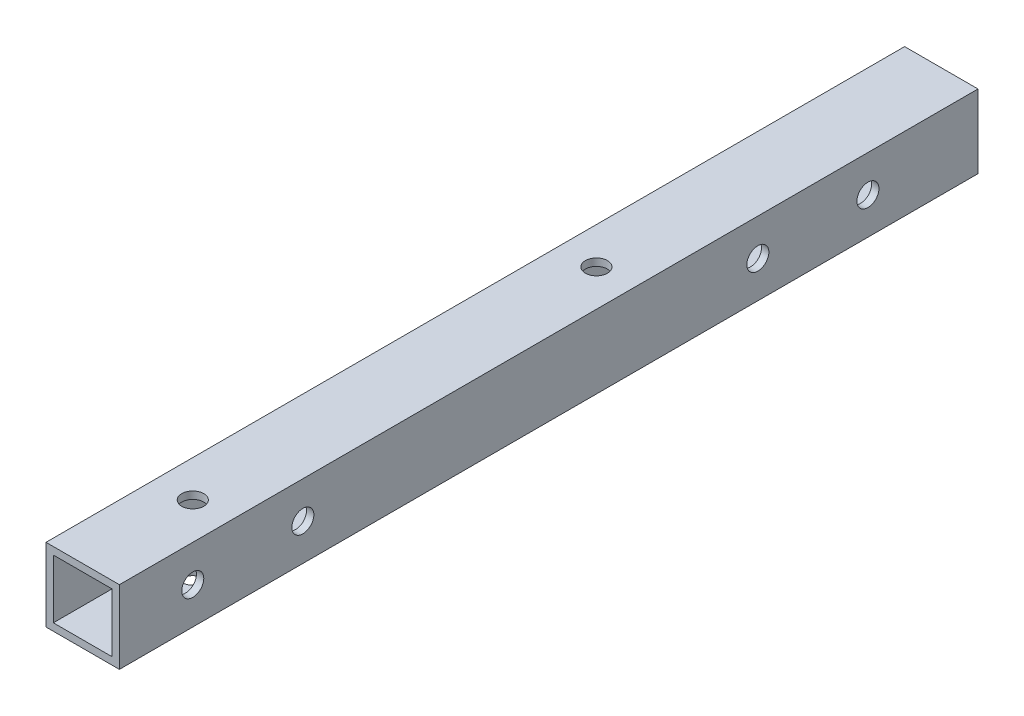
ISO-10303-21;
HEADER;
FILE_DESCRIPTION(('STEP AP214'),'2;1');
FILE_NAME('part.step','',(''),(''),'','','');
FILE_SCHEMA(('AUTOMOTIVE_DESIGN { 1 0 10303 214 1 1 1 1 }'));
ENDSEC;
DATA;
#1=APPLICATION_CONTEXT('core data for automotive mechanical design processes');
#2=APPLICATION_PROTOCOL_DEFINITION('international standard','automotive_design',2000,#1);
#3=PRODUCT_CONTEXT('',#1,'mechanical');
#4=PRODUCT('Part','Part','',(#3));
#5=PRODUCT_RELATED_PRODUCT_CATEGORY('part','',(#4));
#6=PRODUCT_DEFINITION_FORMATION('','',#4);
#7=PRODUCT_DEFINITION_CONTEXT('part definition',#1,'design');
#8=PRODUCT_DEFINITION('design','',#6,#7);
#9=PRODUCT_DEFINITION_SHAPE('','',#8);
#10=(LENGTH_UNIT() NAMED_UNIT(*) SI_UNIT(.MILLI.,.METRE.));
#11=(NAMED_UNIT(*) PLANE_ANGLE_UNIT() SI_UNIT($,.RADIAN.));
#12=(NAMED_UNIT(*) SI_UNIT($,.STERADIAN.) SOLID_ANGLE_UNIT());
#13=UNCERTAINTY_MEASURE_WITH_UNIT(LENGTH_MEASURE(1.E-05),#10,'distance_accuracy_value','');
#14=(GEOMETRIC_REPRESENTATION_CONTEXT(3) GLOBAL_UNCERTAINTY_ASSIGNED_CONTEXT((#13)) GLOBAL_UNIT_ASSIGNED_CONTEXT((#10,
#11,#12)) REPRESENTATION_CONTEXT('',''));
#15=CARTESIAN_POINT('',(0.,0.,0.));
#16=DIRECTION('',(0.,0.,1.));
#17=DIRECTION('',(1.,0.,0.));
#18=AXIS2_PLACEMENT_3D('',#15,#16,#17);
#19=CARTESIAN_POINT('',(0.,0.,117.));
#20=DIRECTION('',(0.,0.,1.));
#21=DIRECTION('',(1.,0.,0.));
#22=AXIS2_PLACEMENT_3D('',#19,#20,#21);
#23=PLANE('',#22);
#24=DIRECTION('',(0.,-1.,0.));
#25=VECTOR('',#24,1.);
#26=CARTESIAN_POINT('',(-5.,-5.,117.));
#27=LINE('',#26,#25);
#28=CARTESIAN_POINT('',(-5.,5.,117.));
#29=VERTEX_POINT('',#28);
#30=CARTESIAN_POINT('',(-5.,-5.,117.));
#31=VERTEX_POINT('',#30);
#32=EDGE_CURVE('E170',#29,#31,#27,.T.);
#33=ORIENTED_EDGE('',*,*,#32,.T.);
#34=DIRECTION('',(1.,0.,0.));
#35=VECTOR('',#34,1.);
#36=CARTESIAN_POINT('',(-5.,-5.,117.));
#37=LINE('',#36,#35);
#38=CARTESIAN_POINT('',(5.,-5.,117.));
#39=VERTEX_POINT('',#38);
#40=EDGE_CURVE('E173',#31,#39,#37,.T.);
#41=ORIENTED_EDGE('',*,*,#40,.T.);
#42=DIRECTION('',(0.,1.,0.));
#43=VECTOR('',#42,1.);
#44=CARTESIAN_POINT('',(5.,-5.,117.));
#45=LINE('',#44,#43);
#46=CARTESIAN_POINT('',(5.,5.,117.));
#47=VERTEX_POINT('',#46);
#48=EDGE_CURVE('E176',#39,#47,#45,.T.);
#49=ORIENTED_EDGE('',*,*,#48,.T.);
#50=DIRECTION('',(-1.,0.,0.));
#51=VECTOR('',#50,1.);
#52=CARTESIAN_POINT('',(-5.,5.,117.));
#53=LINE('',#52,#51);
#54=EDGE_CURVE('E178',#47,#29,#53,.T.);
#55=ORIENTED_EDGE('',*,*,#54,.T.);
#56=EDGE_LOOP('',(#33,#41,#49,#55));
#57=FACE_BOUND('',#56,.T.);
#58=DIRECTION('',(1.,0.,0.));
#59=VECTOR('',#58,1.);
#60=CARTESIAN_POINT('',(0.,-4.,117.));
#61=LINE('',#60,#59);
#62=CARTESIAN_POINT('',(-4.,-4.,117.));
#63=VERTEX_POINT('',#62);
#64=CARTESIAN_POINT('',(4.,-4.,117.));
#65=VERTEX_POINT('',#64);
#66=EDGE_CURVE('E140',#63,#65,#61,.T.);
#67=ORIENTED_EDGE('',*,*,#66,.F.);
#68=DIRECTION('',(0.,-1.,0.));
#69=VECTOR('',#68,1.);
#70=CARTESIAN_POINT('',(-4.,0.,117.));
#71=LINE('',#70,#69);
#72=CARTESIAN_POINT('',(-4.,4.,117.));
#73=VERTEX_POINT('',#72);
#74=EDGE_CURVE('E132',#73,#63,#71,.T.);
#75=ORIENTED_EDGE('',*,*,#74,.F.);
#76=DIRECTION('',(-1.,0.,0.));
#77=VECTOR('',#76,1.);
#78=CARTESIAN_POINT('',(0.,4.,117.));
#79=LINE('',#78,#77);
#80=CARTESIAN_POINT('',(4.,4.,117.));
#81=VERTEX_POINT('',#80);
#82=EDGE_CURVE('E154',#81,#73,#79,.T.);
#83=ORIENTED_EDGE('',*,*,#82,.F.);
#84=DIRECTION('',(0.,1.,0.));
#85=VECTOR('',#84,1.);
#86=CARTESIAN_POINT('',(4.,0.,117.));
#87=LINE('',#86,#85);
#88=EDGE_CURVE('E152',#65,#81,#87,.T.);
#89=ORIENTED_EDGE('',*,*,#88,.F.);
#90=EDGE_LOOP('',(#67,#75,#83,#89));
#91=FACE_BOUND('',#90,.T.);
#92=ADVANCED_FACE('F65',(#57,#91),#23,.T.);
#93=CARTESIAN_POINT('',(0.,0.,0.));
#94=DIRECTION('',(0.,0.,1.));
#95=DIRECTION('',(1.,0.,0.));
#96=AXIS2_PLACEMENT_3D('',#93,#94,#95);
#97=PLANE('',#96);
#98=DIRECTION('',(0.,-1.,0.));
#99=VECTOR('',#98,1.);
#100=CARTESIAN_POINT('',(-5.,-5.,0.));
#101=LINE('',#100,#99);
#102=CARTESIAN_POINT('',(-5.,5.,0.));
#103=VERTEX_POINT('',#102);
#104=CARTESIAN_POINT('',(-5.,-5.,0.));
#105=VERTEX_POINT('',#104);
#106=EDGE_CURVE('E148',#103,#105,#101,.T.);
#107=ORIENTED_EDGE('',*,*,#106,.F.);
#108=DIRECTION('',(-1.,0.,0.));
#109=VECTOR('',#108,1.);
#110=CARTESIAN_POINT('',(-5.,5.,0.));
#111=LINE('',#110,#109);
#112=CARTESIAN_POINT('',(5.,5.,0.));
#113=VERTEX_POINT('',#112);
#114=EDGE_CURVE('E174',#113,#103,#111,.T.);
#115=ORIENTED_EDGE('',*,*,#114,.F.);
#116=DIRECTION('',(0.,1.,0.));
#117=VECTOR('',#116,1.);
#118=CARTESIAN_POINT('',(5.,-5.,0.));
#119=LINE('',#118,#117);
#120=CARTESIAN_POINT('',(5.,-5.,0.));
#121=VERTEX_POINT('',#120);
#122=EDGE_CURVE('E185',#121,#113,#119,.T.);
#123=ORIENTED_EDGE('',*,*,#122,.F.);
#124=DIRECTION('',(1.,0.,0.));
#125=VECTOR('',#124,1.);
#126=CARTESIAN_POINT('',(-5.,-5.,0.));
#127=LINE('',#126,#125);
#128=EDGE_CURVE('E183',#105,#121,#127,.T.);
#129=ORIENTED_EDGE('',*,*,#128,.F.);
#130=EDGE_LOOP('',(#107,#115,#123,#129));
#131=FACE_BOUND('',#130,.T.);
#132=DIRECTION('',(0.,-1.,0.));
#133=VECTOR('',#132,1.);
#134=CARTESIAN_POINT('',(-4.,0.,0.));
#135=LINE('',#134,#133);
#136=CARTESIAN_POINT('',(-4.,4.,0.));
#137=VERTEX_POINT('',#136);
#138=CARTESIAN_POINT('',(-4.,-4.,0.));
#139=VERTEX_POINT('',#138);
#140=EDGE_CURVE('E90',#137,#139,#135,.T.);
#141=ORIENTED_EDGE('',*,*,#140,.T.);
#142=DIRECTION('',(1.,0.,0.));
#143=VECTOR('',#142,1.);
#144=CARTESIAN_POINT('',(0.,-4.,0.));
#145=LINE('',#144,#143);
#146=CARTESIAN_POINT('',(4.,-4.,0.));
#147=VERTEX_POINT('',#146);
#148=EDGE_CURVE('E147',#139,#147,#145,.T.);
#149=ORIENTED_EDGE('',*,*,#148,.T.);
#150=DIRECTION('',(0.,1.,0.));
#151=VECTOR('',#150,1.);
#152=CARTESIAN_POINT('',(4.,0.,0.));
#153=LINE('',#152,#151);
#154=CARTESIAN_POINT('',(4.,4.,0.));
#155=VERTEX_POINT('',#154);
#156=EDGE_CURVE('E162',#147,#155,#153,.T.);
#157=ORIENTED_EDGE('',*,*,#156,.T.);
#158=DIRECTION('',(-1.,0.,0.));
#159=VECTOR('',#158,1.);
#160=CARTESIAN_POINT('',(0.,4.,0.));
#161=LINE('',#160,#159);
#162=EDGE_CURVE('E141',#155,#137,#161,.T.);
#163=ORIENTED_EDGE('',*,*,#162,.T.);
#164=EDGE_LOOP('',(#141,#149,#157,#163));
#165=FACE_BOUND('',#164,.T.);
#166=ADVANCED_FACE('F291',(#131,#165),#97,.F.);
#167=CARTESIAN_POINT('',(-5.,-5.,117.));
#168=DIRECTION('',(1.,0.,0.));
#169=DIRECTION('',(0.,0.,-1.));
#170=AXIS2_PLACEMENT_3D('',#167,#168,#169);
#171=PLANE('',#170);
#172=CARTESIAN_POINT('',(-5.,0.,15.));
#173=DIRECTION('',(1.,0.,0.));
#174=DIRECTION('',(0.,0.,-1.));
#175=AXIS2_PLACEMENT_3D('',#172,#173,#174);
#176=CIRCLE('',#175,1.5);
#177=CARTESIAN_POINT('',(-5.,0.,13.5));
#178=VERTEX_POINT('',#177);
#179=EDGE_CURVE('E199',#178,#178,#176,.T.);
#180=ORIENTED_EDGE('',*,*,#179,.T.);
#181=EDGE_LOOP('',(#180));
#182=FACE_BOUND('',#181,.T.);
#183=CARTESIAN_POINT('',(-5.,0.,92.));
#184=DIRECTION('',(1.,0.,0.));
#185=DIRECTION('',(0.,0.,-1.));
#186=AXIS2_PLACEMENT_3D('',#183,#184,#185);
#187=CIRCLE('',#186,1.5);
#188=CARTESIAN_POINT('',(-5.,0.,90.5));
#189=VERTEX_POINT('',#188);
#190=EDGE_CURVE('E235',#189,#189,#187,.T.);
#191=ORIENTED_EDGE('',*,*,#190,.T.);
#192=EDGE_LOOP('',(#191));
#193=FACE_BOUND('',#192,.T.);
#194=CARTESIAN_POINT('',(-5.,0.,107.));
#195=DIRECTION('',(1.,0.,0.));
#196=DIRECTION('',(0.,0.,-1.));
#197=AXIS2_PLACEMENT_3D('',#194,#195,#196);
#198=CIRCLE('',#197,1.5);
#199=CARTESIAN_POINT('',(-5.,0.,105.5));
#200=VERTEX_POINT('',#199);
#201=EDGE_CURVE('E245',#200,#200,#198,.T.);
#202=ORIENTED_EDGE('',*,*,#201,.T.);
#203=EDGE_LOOP('',(#202));
#204=FACE_BOUND('',#203,.T.);
#205=CARTESIAN_POINT('',(-5.,0.,30.));
#206=DIRECTION('',(1.,0.,0.));
#207=DIRECTION('',(0.,0.,-1.));
#208=AXIS2_PLACEMENT_3D('',#205,#206,#207);
#209=CIRCLE('',#208,1.5);
#210=CARTESIAN_POINT('',(-5.,0.,28.5));
#211=VERTEX_POINT('',#210);
#212=EDGE_CURVE('E250',#211,#211,#209,.T.);
#213=ORIENTED_EDGE('',*,*,#212,.T.);
#214=EDGE_LOOP('',(#213));
#215=FACE_BOUND('',#214,.T.);
#216=ORIENTED_EDGE('',*,*,#106,.T.);
#217=DIRECTION('',(0.,0.,-1.));
#218=VECTOR('',#217,1.);
#219=CARTESIAN_POINT('',(-5.,-5.,117.));
#220=LINE('',#219,#218);
#221=EDGE_CURVE('E12',#31,#105,#220,.T.);
#222=ORIENTED_EDGE('',*,*,#221,.F.);
#223=ORIENTED_EDGE('',*,*,#32,.F.);
#224=DIRECTION('',(0.,0.,-1.));
#225=VECTOR('',#224,1.);
#226=CARTESIAN_POINT('',(-5.,5.,117.));
#227=LINE('',#226,#225);
#228=EDGE_CURVE('E180',#29,#103,#227,.T.);
#229=ORIENTED_EDGE('',*,*,#228,.T.);
#230=EDGE_LOOP('',(#216,#222,#223,#229));
#231=FACE_BOUND('',#230,.T.);
#232=ADVANCED_FACE('F67',(#182,#193,#204,#215,#231),#171,.F.);
#233=CARTESIAN_POINT('',(-5.,-5.,117.));
#234=DIRECTION('',(0.,1.,0.));
#235=DIRECTION('',(0.,0.,1.));
#236=AXIS2_PLACEMENT_3D('',#233,#234,#235);
#237=PLANE('',#236);
#238=CARTESIAN_POINT('',(0.,-5.,102.));
#239=DIRECTION('',(0.,-1.,0.));
#240=DIRECTION('',(0.,0.,-1.));
#241=AXIS2_PLACEMENT_3D('',#238,#239,#240);
#242=CIRCLE('',#241,1.5);
#243=CARTESIAN_POINT('',(0.,-5.,100.5));
#244=VERTEX_POINT('',#243);
#245=EDGE_CURVE('E219',#244,#244,#242,.T.);
#246=ORIENTED_EDGE('',*,*,#245,.F.);
#247=EDGE_LOOP('',(#246));
#248=FACE_BOUND('',#247,.T.);
#249=CARTESIAN_POINT('',(0.,-5.,47.));
#250=DIRECTION('',(0.,-1.,0.));
#251=DIRECTION('',(0.,0.,-1.));
#252=AXIS2_PLACEMENT_3D('',#249,#250,#251);
#253=CIRCLE('',#252,1.5);
#254=CARTESIAN_POINT('',(0.,-5.,45.5));
#255=VERTEX_POINT('',#254);
#256=EDGE_CURVE('E224',#255,#255,#253,.T.);
#257=ORIENTED_EDGE('',*,*,#256,.F.);
#258=EDGE_LOOP('',(#257));
#259=FACE_BOUND('',#258,.T.);
#260=ORIENTED_EDGE('',*,*,#128,.T.);
#261=DIRECTION('',(0.,0.,-1.));
#262=VECTOR('',#261,1.);
#263=CARTESIAN_POINT('',(5.,-5.,117.));
#264=LINE('',#263,#262);
#265=EDGE_CURVE('E74',#39,#121,#264,.T.);
#266=ORIENTED_EDGE('',*,*,#265,.F.);
#267=ORIENTED_EDGE('',*,*,#40,.F.);
#268=ORIENTED_EDGE('',*,*,#221,.T.);
#269=EDGE_LOOP('',(#260,#266,#267,#268));
#270=FACE_BOUND('',#269,.T.);
#271=ADVANCED_FACE('F290',(#248,#259,#270),#237,.F.);
#272=CARTESIAN_POINT('',(5.,-5.,117.));
#273=DIRECTION('',(-1.,0.,0.));
#274=DIRECTION('',(0.,0.,1.));
#275=AXIS2_PLACEMENT_3D('',#272,#273,#274);
#276=PLANE('',#275);
#277=CARTESIAN_POINT('',(5.,0.,15.));
#278=DIRECTION('',(1.,0.,0.));
#279=DIRECTION('',(0.,0.,-1.));
#280=AXIS2_PLACEMENT_3D('',#277,#278,#279);
#281=CIRCLE('',#280,1.5);
#282=CARTESIAN_POINT('',(5.,0.,13.5));
#283=VERTEX_POINT('',#282);
#284=EDGE_CURVE('E238',#283,#283,#281,.T.);
#285=ORIENTED_EDGE('',*,*,#284,.F.);
#286=EDGE_LOOP('',(#285));
#287=FACE_BOUND('',#286,.T.);
#288=CARTESIAN_POINT('',(5.,0.,92.));
#289=DIRECTION('',(1.,0.,0.));
#290=DIRECTION('',(0.,0.,-1.));
#291=AXIS2_PLACEMENT_3D('',#288,#289,#290);
#292=CIRCLE('',#291,1.5);
#293=CARTESIAN_POINT('',(5.,0.,90.5));
#294=VERTEX_POINT('',#293);
#295=EDGE_CURVE('E242',#294,#294,#292,.T.);
#296=ORIENTED_EDGE('',*,*,#295,.F.);
#297=EDGE_LOOP('',(#296));
#298=FACE_BOUND('',#297,.T.);
#299=CARTESIAN_POINT('',(5.,0.,107.));
#300=DIRECTION('',(1.,0.,0.));
#301=DIRECTION('',(0.,0.,-1.));
#302=AXIS2_PLACEMENT_3D('',#299,#300,#301);
#303=CIRCLE('',#302,1.5);
#304=CARTESIAN_POINT('',(5.,0.,105.5));
#305=VERTEX_POINT('',#304);
#306=EDGE_CURVE('E253',#305,#305,#303,.T.);
#307=ORIENTED_EDGE('',*,*,#306,.F.);
#308=EDGE_LOOP('',(#307));
#309=FACE_BOUND('',#308,.T.);
#310=CARTESIAN_POINT('',(5.,0.,30.));
#311=DIRECTION('',(1.,0.,0.));
#312=DIRECTION('',(0.,0.,-1.));
#313=AXIS2_PLACEMENT_3D('',#310,#311,#312);
#314=CIRCLE('',#313,1.5);
#315=CARTESIAN_POINT('',(5.,0.,28.5));
#316=VERTEX_POINT('',#315);
#317=EDGE_CURVE('E241',#316,#316,#314,.T.);
#318=ORIENTED_EDGE('',*,*,#317,.F.);
#319=EDGE_LOOP('',(#318));
#320=FACE_BOUND('',#319,.T.);
#321=ORIENTED_EDGE('',*,*,#122,.T.);
#322=DIRECTION('',(0.,0.,-1.));
#323=VECTOR('',#322,1.);
#324=CARTESIAN_POINT('',(5.,5.,117.));
#325=LINE('',#324,#323);
#326=EDGE_CURVE('E190',#47,#113,#325,.T.);
#327=ORIENTED_EDGE('',*,*,#326,.F.);
#328=ORIENTED_EDGE('',*,*,#48,.F.);
#329=ORIENTED_EDGE('',*,*,#265,.T.);
#330=EDGE_LOOP('',(#321,#327,#328,#329));
#331=FACE_BOUND('',#330,.T.);
#332=ADVANCED_FACE('F309',(#287,#298,#309,#320,#331),#276,.F.);
#333=CARTESIAN_POINT('',(-5.,5.,117.));
#334=DIRECTION('',(0.,-1.,0.));
#335=DIRECTION('',(0.,0.,-1.));
#336=AXIS2_PLACEMENT_3D('',#333,#334,#335);
#337=PLANE('',#336);
#338=CARTESIAN_POINT('',(0.,5.,102.));
#339=DIRECTION('',(0.,-1.,0.));
#340=DIRECTION('',(0.,0.,-1.));
#341=AXIS2_PLACEMENT_3D('',#338,#339,#340);
#342=CIRCLE('',#341,1.5);
#343=CARTESIAN_POINT('',(0.,5.,100.5));
#344=VERTEX_POINT('',#343);
#345=EDGE_CURVE('E213',#344,#344,#342,.T.);
#346=ORIENTED_EDGE('',*,*,#345,.T.);
#347=EDGE_LOOP('',(#346));
#348=FACE_BOUND('',#347,.T.);
#349=CARTESIAN_POINT('',(0.,5.,47.));
#350=DIRECTION('',(0.,-1.,0.));
#351=DIRECTION('',(0.,0.,-1.));
#352=AXIS2_PLACEMENT_3D('',#349,#350,#351);
#353=CIRCLE('',#352,1.5);
#354=CARTESIAN_POINT('',(0.,5.,45.5));
#355=VERTEX_POINT('',#354);
#356=EDGE_CURVE('E229',#355,#355,#353,.T.);
#357=ORIENTED_EDGE('',*,*,#356,.T.);
#358=EDGE_LOOP('',(#357));
#359=FACE_BOUND('',#358,.T.);
#360=ORIENTED_EDGE('',*,*,#114,.T.);
#361=ORIENTED_EDGE('',*,*,#228,.F.);
#362=ORIENTED_EDGE('',*,*,#54,.F.);
#363=ORIENTED_EDGE('',*,*,#326,.T.);
#364=EDGE_LOOP('',(#360,#361,#362,#363));
#365=FACE_BOUND('',#364,.T.);
#366=ADVANCED_FACE('F271',(#348,#359,#365),#337,.F.);
#367=CARTESIAN_POINT('',(-4.,0.,117.));
#368=DIRECTION('',(1.,0.,0.));
#369=DIRECTION('',(0.,0.,-1.));
#370=AXIS2_PLACEMENT_3D('',#367,#368,#369);
#371=PLANE('',#370);
#372=CARTESIAN_POINT('',(-4.,0.,15.));
#373=DIRECTION('',(1.,0.,0.));
#374=DIRECTION('',(0.,0.,-1.));
#375=AXIS2_PLACEMENT_3D('',#372,#373,#374);
#376=CIRCLE('',#375,1.5);
#377=CARTESIAN_POINT('',(-4.,0.,13.5));
#378=VERTEX_POINT('',#377);
#379=EDGE_CURVE('E160',#378,#378,#376,.T.);
#380=ORIENTED_EDGE('',*,*,#379,.F.);
#381=EDGE_LOOP('',(#380));
#382=FACE_BOUND('',#381,.T.);
#383=CARTESIAN_POINT('',(-4.,0.,92.));
#384=DIRECTION('',(1.,0.,0.));
#385=DIRECTION('',(0.,0.,-1.));
#386=AXIS2_PLACEMENT_3D('',#383,#384,#385);
#387=CIRCLE('',#386,1.5);
#388=CARTESIAN_POINT('',(-4.,0.,90.5));
#389=VERTEX_POINT('',#388);
#390=EDGE_CURVE('E207',#389,#389,#387,.T.);
#391=ORIENTED_EDGE('',*,*,#390,.F.);
#392=EDGE_LOOP('',(#391));
#393=FACE_BOUND('',#392,.T.);
#394=CARTESIAN_POINT('',(-4.,0.,107.));
#395=DIRECTION('',(1.,0.,0.));
#396=DIRECTION('',(0.,0.,-1.));
#397=AXIS2_PLACEMENT_3D('',#394,#395,#396);
#398=CIRCLE('',#397,1.5);
#399=CARTESIAN_POINT('',(-4.,0.,105.5));
#400=VERTEX_POINT('',#399);
#401=EDGE_CURVE('E203',#400,#400,#398,.T.);
#402=ORIENTED_EDGE('',*,*,#401,.F.);
#403=EDGE_LOOP('',(#402));
#404=FACE_BOUND('',#403,.T.);
#405=CARTESIAN_POINT('',(-4.,0.,30.));
#406=DIRECTION('',(1.,0.,0.));
#407=DIRECTION('',(0.,0.,-1.));
#408=AXIS2_PLACEMENT_3D('',#405,#406,#407);
#409=CIRCLE('',#408,1.5);
#410=CARTESIAN_POINT('',(-4.,0.,28.5));
#411=VERTEX_POINT('',#410);
#412=EDGE_CURVE('E198',#411,#411,#409,.T.);
#413=ORIENTED_EDGE('',*,*,#412,.F.);
#414=EDGE_LOOP('',(#413));
#415=FACE_BOUND('',#414,.T.);
#416=ORIENTED_EDGE('',*,*,#140,.F.);
#417=DIRECTION('',(0.,0.,-1.));
#418=VECTOR('',#417,1.);
#419=CARTESIAN_POINT('',(-4.,4.,117.));
#420=LINE('',#419,#418);
#421=EDGE_CURVE('E136',#73,#137,#420,.T.);
#422=ORIENTED_EDGE('',*,*,#421,.F.);
#423=ORIENTED_EDGE('',*,*,#74,.T.);
#424=DIRECTION('',(0.,0.,-1.));
#425=VECTOR('',#424,1.);
#426=CARTESIAN_POINT('',(-4.,-4.,117.));
#427=LINE('',#426,#425);
#428=EDGE_CURVE('E135',#63,#139,#427,.T.);
#429=ORIENTED_EDGE('',*,*,#428,.T.);
#430=EDGE_LOOP('',(#416,#422,#423,#429));
#431=FACE_BOUND('',#430,.T.);
#432=ADVANCED_FACE('F134',(#382,#393,#404,#415,#431),#371,.T.);
#433=CARTESIAN_POINT('',(0.,-4.,117.));
#434=DIRECTION('',(0.,1.,0.));
#435=DIRECTION('',(0.,0.,1.));
#436=AXIS2_PLACEMENT_3D('',#433,#434,#435);
#437=PLANE('',#436);
#438=CARTESIAN_POINT('',(0.,-4.00000000000001,102.));
#439=DIRECTION('',(0.,1.,0.));
#440=DIRECTION('',(0.,0.,1.));
#441=AXIS2_PLACEMENT_3D('',#438,#439,#440);
#442=CIRCLE('',#441,1.5);
#443=CARTESIAN_POINT('',(0.,-4.00000000000001,103.5));
#444=VERTEX_POINT('',#443);
#445=EDGE_CURVE('E232',#444,#444,#442,.T.);
#446=ORIENTED_EDGE('',*,*,#445,.F.);
#447=EDGE_LOOP('',(#446));
#448=FACE_BOUND('',#447,.T.);
#449=CARTESIAN_POINT('',(0.,-4.00000000000001,47.));
#450=DIRECTION('',(0.,1.,0.));
#451=DIRECTION('',(0.,0.,1.));
#452=AXIS2_PLACEMENT_3D('',#449,#450,#451);
#453=CIRCLE('',#452,1.5);
#454=CARTESIAN_POINT('',(0.,-4.00000000000001,48.5));
#455=VERTEX_POINT('',#454);
#456=EDGE_CURVE('E212',#455,#455,#453,.T.);
#457=ORIENTED_EDGE('',*,*,#456,.F.);
#458=EDGE_LOOP('',(#457));
#459=FACE_BOUND('',#458,.T.);
#460=ORIENTED_EDGE('',*,*,#148,.F.);
#461=ORIENTED_EDGE('',*,*,#428,.F.);
#462=ORIENTED_EDGE('',*,*,#66,.T.);
#463=DIRECTION('',(0.,0.,-1.));
#464=VECTOR('',#463,1.);
#465=CARTESIAN_POINT('',(4.,-4.,117.));
#466=LINE('',#465,#464);
#467=EDGE_CURVE('E149',#65,#147,#466,.T.);
#468=ORIENTED_EDGE('',*,*,#467,.T.);
#469=EDGE_LOOP('',(#460,#461,#462,#468));
#470=FACE_BOUND('',#469,.T.);
#471=ADVANCED_FACE('F144',(#448,#459,#470),#437,.T.);
#472=CARTESIAN_POINT('',(4.,0.,117.));
#473=DIRECTION('',(-1.,0.,0.));
#474=DIRECTION('',(0.,0.,1.));
#475=AXIS2_PLACEMENT_3D('',#472,#473,#474);
#476=PLANE('',#475);
#477=CARTESIAN_POINT('',(4.,0.,15.));
#478=DIRECTION('',(-1.,0.,0.));
#479=DIRECTION('',(0.,0.,1.));
#480=AXIS2_PLACEMENT_3D('',#477,#478,#479);
#481=CIRCLE('',#480,1.5);
#482=CARTESIAN_POINT('',(4.,0.,16.5));
#483=VERTEX_POINT('',#482);
#484=EDGE_CURVE('E208',#483,#483,#481,.T.);
#485=ORIENTED_EDGE('',*,*,#484,.F.);
#486=EDGE_LOOP('',(#485));
#487=FACE_BOUND('',#486,.T.);
#488=CARTESIAN_POINT('',(4.,0.,92.));
#489=DIRECTION('',(-1.,0.,0.));
#490=DIRECTION('',(0.,0.,1.));
#491=AXIS2_PLACEMENT_3D('',#488,#489,#490);
#492=CIRCLE('',#491,1.5);
#493=CARTESIAN_POINT('',(4.,0.,93.5));
#494=VERTEX_POINT('',#493);
#495=EDGE_CURVE('E204',#494,#494,#492,.T.);
#496=ORIENTED_EDGE('',*,*,#495,.F.);
#497=EDGE_LOOP('',(#496));
#498=FACE_BOUND('',#497,.T.);
#499=CARTESIAN_POINT('',(4.,0.,107.));
#500=DIRECTION('',(-1.,0.,0.));
#501=DIRECTION('',(0.,0.,1.));
#502=AXIS2_PLACEMENT_3D('',#499,#500,#501);
#503=CIRCLE('',#502,1.5);
#504=CARTESIAN_POINT('',(4.,0.,108.5));
#505=VERTEX_POINT('',#504);
#506=EDGE_CURVE('E200',#505,#505,#503,.T.);
#507=ORIENTED_EDGE('',*,*,#506,.F.);
#508=EDGE_LOOP('',(#507));
#509=FACE_BOUND('',#508,.T.);
#510=CARTESIAN_POINT('',(4.,0.,30.));
#511=DIRECTION('',(-1.,0.,0.));
#512=DIRECTION('',(0.,0.,1.));
#513=AXIS2_PLACEMENT_3D('',#510,#511,#512);
#514=CIRCLE('',#513,1.5);
#515=CARTESIAN_POINT('',(4.,0.,31.5));
#516=VERTEX_POINT('',#515);
#517=EDGE_CURVE('E195',#516,#516,#514,.T.);
#518=ORIENTED_EDGE('',*,*,#517,.F.);
#519=EDGE_LOOP('',(#518));
#520=FACE_BOUND('',#519,.T.);
#521=ORIENTED_EDGE('',*,*,#156,.F.);
#522=ORIENTED_EDGE('',*,*,#467,.F.);
#523=ORIENTED_EDGE('',*,*,#88,.T.);
#524=DIRECTION('',(0.,0.,-1.));
#525=VECTOR('',#524,1.);
#526=CARTESIAN_POINT('',(4.,4.,117.));
#527=LINE('',#526,#525);
#528=EDGE_CURVE('E82',#81,#155,#527,.T.);
#529=ORIENTED_EDGE('',*,*,#528,.T.);
#530=EDGE_LOOP('',(#521,#522,#523,#529));
#531=FACE_BOUND('',#530,.T.);
#532=ADVANCED_FACE('F330',(#487,#498,#509,#520,#531),#476,.T.);
#533=CARTESIAN_POINT('',(0.,4.,117.));
#534=DIRECTION('',(0.,-1.,0.));
#535=DIRECTION('',(0.,0.,-1.));
#536=AXIS2_PLACEMENT_3D('',#533,#534,#535);
#537=PLANE('',#536);
#538=CARTESIAN_POINT('',(0.,4.,102.));
#539=DIRECTION('',(0.,-1.,0.));
#540=DIRECTION('',(0.,0.,-1.));
#541=AXIS2_PLACEMENT_3D('',#538,#539,#540);
#542=CIRCLE('',#541,1.5);
#543=CARTESIAN_POINT('',(0.,4.,100.5));
#544=VERTEX_POINT('',#543);
#545=EDGE_CURVE('E69',#544,#544,#542,.T.);
#546=ORIENTED_EDGE('',*,*,#545,.F.);
#547=EDGE_LOOP('',(#546));
#548=FACE_BOUND('',#547,.T.);
#549=CARTESIAN_POINT('',(0.,4.,47.));
#550=DIRECTION('',(0.,-1.,0.));
#551=DIRECTION('',(0.,0.,-1.));
#552=AXIS2_PLACEMENT_3D('',#549,#550,#551);
#553=CIRCLE('',#552,1.5);
#554=CARTESIAN_POINT('',(0.,4.,45.5));
#555=VERTEX_POINT('',#554);
#556=EDGE_CURVE('E210',#555,#555,#553,.T.);
#557=ORIENTED_EDGE('',*,*,#556,.F.);
#558=EDGE_LOOP('',(#557));
#559=FACE_BOUND('',#558,.T.);
#560=ORIENTED_EDGE('',*,*,#162,.F.);
#561=ORIENTED_EDGE('',*,*,#528,.F.);
#562=ORIENTED_EDGE('',*,*,#82,.T.);
#563=ORIENTED_EDGE('',*,*,#421,.T.);
#564=EDGE_LOOP('',(#560,#561,#562,#563));
#565=FACE_BOUND('',#564,.T.);
#566=ADVANCED_FACE('F334',(#548,#559,#565),#537,.T.);
#567=CARTESIAN_POINT('',(-5.,0.,30.));
#568=DIRECTION('',(1.,0.,0.));
#569=DIRECTION('',(0.,0.,-1.));
#570=AXIS2_PLACEMENT_3D('',#567,#568,#569);
#571=CYLINDRICAL_SURFACE('',#570,1.5);
#572=ORIENTED_EDGE('',*,*,#517,.T.);
#573=EDGE_LOOP('',(#572));
#574=FACE_BOUND('',#573,.T.);
#575=ORIENTED_EDGE('',*,*,#317,.T.);
#576=EDGE_LOOP('',(#575));
#577=FACE_BOUND('',#576,.T.);
#578=ADVANCED_FACE('F285',(#574,#577),#571,.F.);
#579=CARTESIAN_POINT('',(-5.,0.,107.));
#580=DIRECTION('',(1.,0.,0.));
#581=DIRECTION('',(0.,0.,-1.));
#582=AXIS2_PLACEMENT_3D('',#579,#580,#581);
#583=CYLINDRICAL_SURFACE('',#582,1.5);
#584=ORIENTED_EDGE('',*,*,#506,.T.);
#585=EDGE_LOOP('',(#584));
#586=FACE_BOUND('',#585,.T.);
#587=ORIENTED_EDGE('',*,*,#306,.T.);
#588=EDGE_LOOP('',(#587));
#589=FACE_BOUND('',#588,.T.);
#590=ADVANCED_FACE('F339',(#586,#589),#583,.F.);
#591=CARTESIAN_POINT('',(-5.,0.,92.));
#592=DIRECTION('',(1.,0.,0.));
#593=DIRECTION('',(0.,0.,-1.));
#594=AXIS2_PLACEMENT_3D('',#591,#592,#593);
#595=CYLINDRICAL_SURFACE('',#594,1.5);
#596=ORIENTED_EDGE('',*,*,#495,.T.);
#597=EDGE_LOOP('',(#596));
#598=FACE_BOUND('',#597,.T.);
#599=ORIENTED_EDGE('',*,*,#295,.T.);
#600=EDGE_LOOP('',(#599));
#601=FACE_BOUND('',#600,.T.);
#602=ADVANCED_FACE('F341',(#598,#601),#595,.F.);
#603=CARTESIAN_POINT('',(-5.,0.,15.));
#604=DIRECTION('',(1.,0.,0.));
#605=DIRECTION('',(0.,0.,-1.));
#606=AXIS2_PLACEMENT_3D('',#603,#604,#605);
#607=CYLINDRICAL_SURFACE('',#606,1.5);
#608=ORIENTED_EDGE('',*,*,#484,.T.);
#609=EDGE_LOOP('',(#608));
#610=FACE_BOUND('',#609,.T.);
#611=ORIENTED_EDGE('',*,*,#284,.T.);
#612=EDGE_LOOP('',(#611));
#613=FACE_BOUND('',#612,.T.);
#614=ADVANCED_FACE('F283',(#610,#613),#607,.F.);
#615=ORIENTED_EDGE('',*,*,#412,.T.);
#616=EDGE_LOOP('',(#615));
#617=FACE_BOUND('',#616,.T.);
#618=ORIENTED_EDGE('',*,*,#212,.F.);
#619=EDGE_LOOP('',(#618));
#620=FACE_BOUND('',#619,.T.);
#621=ADVANCED_FACE('F279',(#617,#620),#571,.F.);
#622=ORIENTED_EDGE('',*,*,#401,.T.);
#623=EDGE_LOOP('',(#622));
#624=FACE_BOUND('',#623,.T.);
#625=ORIENTED_EDGE('',*,*,#201,.F.);
#626=EDGE_LOOP('',(#625));
#627=FACE_BOUND('',#626,.T.);
#628=ADVANCED_FACE('F282',(#624,#627),#583,.F.);
#629=ORIENTED_EDGE('',*,*,#390,.T.);
#630=EDGE_LOOP('',(#629));
#631=FACE_BOUND('',#630,.T.);
#632=ORIENTED_EDGE('',*,*,#190,.F.);
#633=EDGE_LOOP('',(#632));
#634=FACE_BOUND('',#633,.T.);
#635=ADVANCED_FACE('F349',(#631,#634),#595,.F.);
#636=ORIENTED_EDGE('',*,*,#379,.T.);
#637=EDGE_LOOP('',(#636));
#638=FACE_BOUND('',#637,.T.);
#639=ORIENTED_EDGE('',*,*,#179,.F.);
#640=EDGE_LOOP('',(#639));
#641=FACE_BOUND('',#640,.T.);
#642=ADVANCED_FACE('F266',(#638,#641),#607,.F.);
#643=CARTESIAN_POINT('',(0.,5.,47.));
#644=DIRECTION('',(0.,-1.,0.));
#645=DIRECTION('',(0.,0.,-1.));
#646=AXIS2_PLACEMENT_3D('',#643,#644,#645);
#647=CYLINDRICAL_SURFACE('',#646,1.5);
#648=ORIENTED_EDGE('',*,*,#556,.T.);
#649=EDGE_LOOP('',(#648));
#650=FACE_BOUND('',#649,.T.);
#651=ORIENTED_EDGE('',*,*,#356,.F.);
#652=EDGE_LOOP('',(#651));
#653=FACE_BOUND('',#652,.T.);
#654=ADVANCED_FACE('F353',(#650,#653),#647,.F.);
#655=CARTESIAN_POINT('',(0.,5.,102.));
#656=DIRECTION('',(0.,-1.,0.));
#657=DIRECTION('',(0.,0.,-1.));
#658=AXIS2_PLACEMENT_3D('',#655,#656,#657);
#659=CYLINDRICAL_SURFACE('',#658,1.5);
#660=ORIENTED_EDGE('',*,*,#545,.T.);
#661=EDGE_LOOP('',(#660));
#662=FACE_BOUND('',#661,.T.);
#663=ORIENTED_EDGE('',*,*,#345,.F.);
#664=EDGE_LOOP('',(#663));
#665=FACE_BOUND('',#664,.T.);
#666=ADVANCED_FACE('F356',(#662,#665),#659,.F.);
#667=ORIENTED_EDGE('',*,*,#456,.T.);
#668=EDGE_LOOP('',(#667));
#669=FACE_BOUND('',#668,.T.);
#670=ORIENTED_EDGE('',*,*,#256,.T.);
#671=EDGE_LOOP('',(#670));
#672=FACE_BOUND('',#671,.T.);
#673=ADVANCED_FACE('F357',(#669,#672),#647,.F.);
#674=ORIENTED_EDGE('',*,*,#445,.T.);
#675=EDGE_LOOP('',(#674));
#676=FACE_BOUND('',#675,.T.);
#677=ORIENTED_EDGE('',*,*,#245,.T.);
#678=EDGE_LOOP('',(#677));
#679=FACE_BOUND('',#678,.T.);
#680=ADVANCED_FACE('F360',(#676,#679),#659,.F.);
#681=CLOSED_SHELL('',(#92,#166,#232,#271,#332,#366,#432,#471,#532,#566,#578,#590,#602,#614,#621,
#628,#635,#642,#654,#666,#673,#680));
#682=MANIFOLD_SOLID_BREP('B2',#681);
#683=ADVANCED_BREP_SHAPE_REPRESENTATION('',(#18,#682),#14);
#684=SHAPE_DEFINITION_REPRESENTATION(#9,#683);
ENDSEC;
END-ISO-10303-21;
